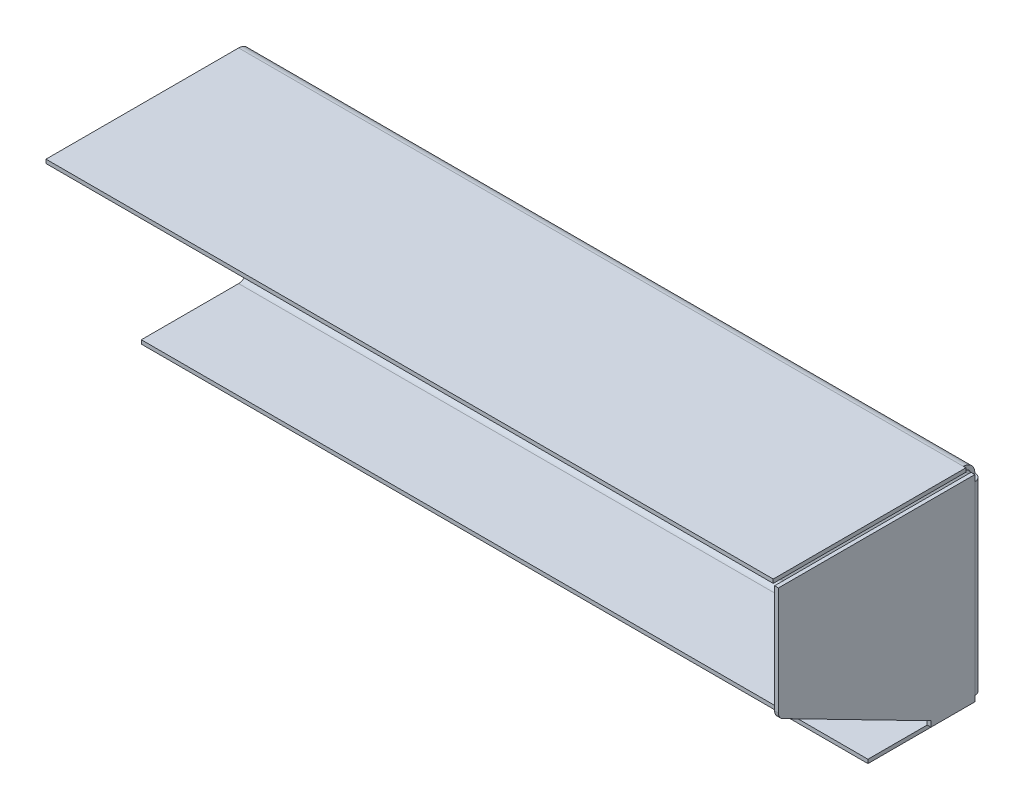
ISO-10303-21;
HEADER;
FILE_DESCRIPTION(('STEP AP214'),'2;1');
FILE_NAME('part.step','',(''),(''),'','','');
FILE_SCHEMA(('AUTOMOTIVE_DESIGN { 1 0 10303 214 1 1 1 1 }'));
ENDSEC;
DATA;
#1=APPLICATION_CONTEXT('core data for automotive mechanical design processes');
#2=APPLICATION_PROTOCOL_DEFINITION('international standard','automotive_design',2000,#1);
#3=PRODUCT_CONTEXT('',#1,'mechanical');
#4=PRODUCT('Part','Part','',(#3));
#5=PRODUCT_RELATED_PRODUCT_CATEGORY('part','',(#4));
#6=PRODUCT_DEFINITION_FORMATION('','',#4);
#7=PRODUCT_DEFINITION_CONTEXT('part definition',#1,'design');
#8=PRODUCT_DEFINITION('design','',#6,#7);
#9=PRODUCT_DEFINITION_SHAPE('','',#8);
#10=(LENGTH_UNIT() NAMED_UNIT(*) SI_UNIT(.MILLI.,.METRE.));
#11=(NAMED_UNIT(*) PLANE_ANGLE_UNIT() SI_UNIT($,.RADIAN.));
#12=(NAMED_UNIT(*) SI_UNIT($,.STERADIAN.) SOLID_ANGLE_UNIT());
#13=UNCERTAINTY_MEASURE_WITH_UNIT(LENGTH_MEASURE(1.E-05),#10,'distance_accuracy_value','');
#14=(GEOMETRIC_REPRESENTATION_CONTEXT(3) GLOBAL_UNCERTAINTY_ASSIGNED_CONTEXT((#13)) GLOBAL_UNIT_ASSIGNED_CONTEXT((#10,
#11,#12)) REPRESENTATION_CONTEXT('',''));
#15=CARTESIAN_POINT('',(0.,0.,0.));
#16=DIRECTION('',(0.,0.,1.));
#17=DIRECTION('',(1.,0.,0.));
#18=AXIS2_PLACEMENT_3D('',#15,#16,#17);
#19=CARTESIAN_POINT('',(0.,0.,-1.99999999999995));
#20=DIRECTION('',(0.,0.,-1.));
#21=DIRECTION('',(-1.,0.,0.));
#22=AXIS2_PLACEMENT_3D('',#19,#20,#21);
#23=PLANE('',#22);
#24=CARTESIAN_POINT('',(175.,-12.5,-1.99999999999995));
#25=DIRECTION('',(0.,0.,1.));
#26=DIRECTION('',(1.,0.,0.));
#27=AXIS2_PLACEMENT_3D('',#24,#25,#26);
#28=CIRCLE('',#27,12.5);
#29=CARTESIAN_POINT('',(187.5,-12.5,-1.99999999999995));
#30=VERTEX_POINT('',#29);
#31=EDGE_CURVE('E456',#30,#30,#28,.T.);
#32=ORIENTED_EDGE('',*,*,#31,.T.);
#33=EDGE_LOOP('',(#32));
#34=FACE_BOUND('',#33,.T.);
#35=CARTESIAN_POINT('',(-175.,-12.5,-1.99999999999995));
#36=DIRECTION('',(0.,0.,1.));
#37=DIRECTION('',(-1.,0.,0.));
#38=AXIS2_PLACEMENT_3D('',#35,#36,#37);
#39=CIRCLE('',#38,12.5);
#40=CARTESIAN_POINT('',(-187.5,-12.5,-1.99999999999995));
#41=VERTEX_POINT('',#40);
#42=EDGE_CURVE('E450',#41,#41,#39,.T.);
#43=ORIENTED_EDGE('',*,*,#42,.T.);
#44=EDGE_LOOP('',(#43));
#45=FACE_BOUND('',#44,.T.);
#46=DIRECTION('',(1.,0.,0.));
#47=VECTOR('',#46,1.);
#48=CARTESIAN_POINT('',(-192.,48.5,-2.));
#49=LINE('',#48,#47);
#50=CARTESIAN_POINT('',(-192.,48.5,-2.));
#51=VERTEX_POINT('',#50);
#52=CARTESIAN_POINT('',(188.,48.4999999999999,-2.));
#53=VERTEX_POINT('',#52);
#54=EDGE_CURVE('E480',#51,#53,#49,.T.);
#55=ORIENTED_EDGE('',*,*,#54,.T.);
#56=DIRECTION('',(0.,-1.,0.));
#57=VECTOR('',#56,1.);
#58=CARTESIAN_POINT('',(188.,48.5,-1.99999999999997));
#59=LINE('',#58,#57);
#60=CARTESIAN_POINT('',(188.,-48.4999999999999,-1.99999999999995));
#61=VERTEX_POINT('',#60);
#62=EDGE_CURVE('E473',#53,#61,#59,.T.);
#63=ORIENTED_EDGE('',*,*,#62,.T.);
#64=DIRECTION('',(-1.,0.,0.));
#65=VECTOR('',#64,1.);
#66=CARTESIAN_POINT('',(192.,-48.5,-1.99999999999995));
#67=LINE('',#66,#65);
#68=CARTESIAN_POINT('',(-192.,-48.5,-1.99999999999995));
#69=VERTEX_POINT('',#68);
#70=EDGE_CURVE('E464',#61,#69,#67,.T.);
#71=ORIENTED_EDGE('',*,*,#70,.T.);
#72=DIRECTION('',(0.,-1.,0.));
#73=VECTOR('',#72,1.);
#74=CARTESIAN_POINT('',(-192.,-54.5,-1.99999999999995));
#75=LINE('',#74,#73);
#76=EDGE_CURVE('E461',#51,#69,#75,.T.);
#77=ORIENTED_EDGE('',*,*,#76,.F.);
#78=EDGE_LOOP('',(#55,#63,#71,#77));
#79=FACE_BOUND('',#78,.T.);
#80=ADVANCED_FACE('F107',(#34,#45,#79),#23,.T.);
#81=CARTESIAN_POINT('',(0.,0.,0.));
#82=DIRECTION('',(0.,0.,-1.));
#83=DIRECTION('',(-1.,0.,0.));
#84=AXIS2_PLACEMENT_3D('',#81,#82,#83);
#85=PLANE('',#84);
#86=CARTESIAN_POINT('',(175.,-12.5,0.));
#87=DIRECTION('',(0.,0.,1.));
#88=DIRECTION('',(1.,0.,0.));
#89=AXIS2_PLACEMENT_3D('',#86,#87,#88);
#90=CIRCLE('',#89,12.5);
#91=CARTESIAN_POINT('',(187.5,-12.5,0.));
#92=VERTEX_POINT('',#91);
#93=EDGE_CURVE('E453',#92,#92,#90,.T.);
#94=ORIENTED_EDGE('',*,*,#93,.F.);
#95=EDGE_LOOP('',(#94));
#96=FACE_BOUND('',#95,.T.);
#97=CARTESIAN_POINT('',(-175.,-12.5,0.));
#98=DIRECTION('',(0.,0.,1.));
#99=DIRECTION('',(-1.,0.,0.));
#100=AXIS2_PLACEMENT_3D('',#97,#98,#99);
#101=CIRCLE('',#100,12.5);
#102=CARTESIAN_POINT('',(-187.5,-12.5,0.));
#103=VERTEX_POINT('',#102);
#104=EDGE_CURVE('E445',#103,#103,#101,.T.);
#105=ORIENTED_EDGE('',*,*,#104,.F.);
#106=EDGE_LOOP('',(#105));
#107=FACE_BOUND('',#106,.T.);
#108=DIRECTION('',(0.,-1.,0.));
#109=VECTOR('',#108,1.);
#110=CARTESIAN_POINT('',(188.,48.5,0.));
#111=LINE('',#110,#109);
#112=CARTESIAN_POINT('',(188.,48.4999999999998,0.));
#113=VERTEX_POINT('',#112);
#114=CARTESIAN_POINT('',(188.,-48.5,0.));
#115=VERTEX_POINT('',#114);
#116=EDGE_CURVE('E122',#113,#115,#111,.T.);
#117=ORIENTED_EDGE('',*,*,#116,.F.);
#118=DIRECTION('',(1.,0.,0.));
#119=VECTOR('',#118,1.);
#120=CARTESIAN_POINT('',(-192.,48.5,0.));
#121=LINE('',#120,#119);
#122=CARTESIAN_POINT('',(-192.,48.5,0.));
#123=VERTEX_POINT('',#122);
#124=EDGE_CURVE('E115',#123,#113,#121,.T.);
#125=ORIENTED_EDGE('',*,*,#124,.F.);
#126=DIRECTION('',(0.,-1.,0.));
#127=VECTOR('',#126,1.);
#128=CARTESIAN_POINT('',(-192.,-54.5,0.));
#129=LINE('',#128,#127);
#130=CARTESIAN_POINT('',(-192.,-48.5,0.));
#131=VERTEX_POINT('',#130);
#132=EDGE_CURVE('E130',#123,#131,#129,.T.);
#133=ORIENTED_EDGE('',*,*,#132,.T.);
#134=DIRECTION('',(-1.,0.,0.));
#135=VECTOR('',#134,1.);
#136=CARTESIAN_POINT('',(192.,-48.5,0.));
#137=LINE('',#136,#135);
#138=EDGE_CURVE('E467',#115,#131,#137,.T.);
#139=ORIENTED_EDGE('',*,*,#138,.F.);
#140=EDGE_LOOP('',(#117,#125,#133,#139));
#141=FACE_BOUND('',#140,.T.);
#142=ADVANCED_FACE('F556',(#96,#107,#141),#85,.F.);
#143=CARTESIAN_POINT('',(-192.,-54.5,-1.99999999999995));
#144=DIRECTION('',(-1.,0.,0.));
#145=DIRECTION('',(0.,0.,1.));
#146=AXIS2_PLACEMENT_3D('',#143,#144,#145);
#147=PLANE('',#146);
#148=ORIENTED_EDGE('',*,*,#132,.F.);
#149=DIRECTION('',(0.,0.,-1.));
#150=VECTOR('',#149,1.);
#151=CARTESIAN_POINT('',(-192.,48.5,0.));
#152=LINE('',#151,#150);
#153=EDGE_CURVE('E482',#123,#51,#152,.T.);
#154=ORIENTED_EDGE('',*,*,#153,.T.);
#155=ORIENTED_EDGE('',*,*,#76,.T.);
#156=DIRECTION('',(0.,0.,-1.));
#157=VECTOR('',#156,1.);
#158=CARTESIAN_POINT('',(-192.,-48.5,0.));
#159=LINE('',#158,#157);
#160=EDGE_CURVE('E470',#131,#69,#159,.T.);
#161=ORIENTED_EDGE('',*,*,#160,.F.);
#162=EDGE_LOOP('',(#148,#154,#155,#161));
#163=FACE_BOUND('',#162,.T.);
#164=ADVANCED_FACE('F109',(#163),#147,.T.);
#165=CARTESIAN_POINT('',(175.,-12.5,-1.99999999999995));
#166=DIRECTION('',(0.,0.,1.));
#167=DIRECTION('',(1.,0.,0.));
#168=AXIS2_PLACEMENT_3D('',#165,#166,#167);
#169=CYLINDRICAL_SURFACE('',#168,12.5);
#170=ORIENTED_EDGE('',*,*,#31,.F.);
#171=EDGE_LOOP('',(#170));
#172=FACE_BOUND('',#171,.T.);
#173=ORIENTED_EDGE('',*,*,#93,.T.);
#174=EDGE_LOOP('',(#173));
#175=FACE_BOUND('',#174,.T.);
#176=ADVANCED_FACE('F565',(#172,#175),#169,.F.);
#177=CARTESIAN_POINT('',(-175.,-12.5,-1.99999999999995));
#178=DIRECTION('',(0.,0.,1.));
#179=DIRECTION('',(1.,0.,0.));
#180=AXIS2_PLACEMENT_3D('',#177,#178,#179);
#181=CYLINDRICAL_SURFACE('',#180,12.5);
#182=ORIENTED_EDGE('',*,*,#42,.F.);
#183=EDGE_LOOP('',(#182));
#184=FACE_BOUND('',#183,.T.);
#185=ORIENTED_EDGE('',*,*,#104,.T.);
#186=EDGE_LOOP('',(#185));
#187=FACE_BOUND('',#186,.T.);
#188=ADVANCED_FACE('F568',(#184,#187),#181,.F.);
#189=CARTESIAN_POINT('',(-192.,-48.5,4.00000000000006));
#190=DIRECTION('',(-1.,0.,0.));
#191=DIRECTION('',(0.,0.,1.));
#192=AXIS2_PLACEMENT_3D('',#189,#190,#191);
#193=PLANE('',#192);
#194=DIRECTION('',(0.,-1.,0.));
#195=VECTOR('',#194,1.);
#196=CARTESIAN_POINT('',(-192.,-54.5,4.00000000000009));
#197=LINE('',#196,#195);
#198=CARTESIAN_POINT('',(-192.,-52.5,4.00000000000011));
#199=VERTEX_POINT('',#198);
#200=CARTESIAN_POINT('',(-192.,-54.5,4.00000000000003));
#201=VERTEX_POINT('',#200);
#202=EDGE_CURVE('E405',#199,#201,#197,.T.);
#203=ORIENTED_EDGE('',*,*,#202,.F.);
#204=CARTESIAN_POINT('',(-192.,-48.5,4.00000000000006));
#205=DIRECTION('',(-1.,0.,0.));
#206=DIRECTION('',(0.,0.,1.));
#207=AXIS2_PLACEMENT_3D('',#204,#205,#206);
#208=CIRCLE('',#207,4.);
#209=EDGE_CURVE('E401',#199,#131,#208,.F.);
#210=ORIENTED_EDGE('',*,*,#209,.T.);
#211=ORIENTED_EDGE('',*,*,#160,.T.);
#212=CARTESIAN_POINT('',(-192.,-48.5,4.00000000000006));
#213=DIRECTION('',(1.,0.,0.));
#214=DIRECTION('',(0.,0.,-1.));
#215=AXIS2_PLACEMENT_3D('',#212,#213,#214);
#216=CIRCLE('',#215,6.);
#217=EDGE_CURVE('E438',#201,#69,#216,.T.);
#218=ORIENTED_EDGE('',*,*,#217,.F.);
#219=EDGE_LOOP('',(#203,#210,#211,#218));
#220=FACE_BOUND('',#219,.T.);
#221=ADVANCED_FACE('F513',(#220),#193,.T.);
#222=CARTESIAN_POINT('',(188.,-48.5,4.00000000000006));
#223=DIRECTION('',(1.,0.,0.));
#224=DIRECTION('',(0.,0.,-1.));
#225=AXIS2_PLACEMENT_3D('',#222,#223,#224);
#226=PLANE('',#225);
#227=CARTESIAN_POINT('',(188.,-48.5,4.00000000000006));
#228=DIRECTION('',(-1.,0.,0.));
#229=DIRECTION('',(0.,0.,1.));
#230=AXIS2_PLACEMENT_3D('',#227,#228,#229);
#231=CIRCLE('',#230,4.);
#232=CARTESIAN_POINT('',(188.,-52.5,4.00000000000011));
#233=VERTEX_POINT('',#232);
#234=EDGE_CURVE('E442',#115,#233,#231,.T.);
#235=ORIENTED_EDGE('',*,*,#234,.T.);
#236=DIRECTION('',(0.,-1.,0.));
#237=VECTOR('',#236,1.);
#238=CARTESIAN_POINT('',(188.,-52.5,4.00000000000011));
#239=LINE('',#238,#237);
#240=CARTESIAN_POINT('',(188.,-54.5,4.00000000000011));
#241=VERTEX_POINT('',#240);
#242=EDGE_CURVE('E430',#233,#241,#239,.T.);
#243=ORIENTED_EDGE('',*,*,#242,.T.);
#244=CARTESIAN_POINT('',(188.,-48.5,4.00000000000006));
#245=DIRECTION('',(-1.,0.,0.));
#246=DIRECTION('',(0.,0.,1.));
#247=AXIS2_PLACEMENT_3D('',#244,#245,#246);
#248=CIRCLE('',#247,6.);
#249=EDGE_CURVE('E441',#61,#241,#248,.T.);
#250=ORIENTED_EDGE('',*,*,#249,.F.);
#251=DIRECTION('',(0.,0.,-1.));
#252=VECTOR('',#251,1.);
#253=CARTESIAN_POINT('',(188.,-48.5,0.));
#254=LINE('',#253,#252);
#255=EDGE_CURVE('E477',#115,#61,#254,.T.);
#256=ORIENTED_EDGE('',*,*,#255,.F.);
#257=EDGE_LOOP('',(#235,#243,#250,#256));
#258=FACE_BOUND('',#257,.T.);
#259=ADVANCED_FACE('F526',(#258),#226,.T.);
#260=CARTESIAN_POINT('',(378.086417841399,-48.5,4.00000000000003));
#261=DIRECTION('',(-1.,0.,0.));
#262=DIRECTION('',(0.,0.,1.));
#263=AXIS2_PLACEMENT_3D('',#260,#261,#262);
#264=CYLINDRICAL_SURFACE('',#263,6.);
#265=ORIENTED_EDGE('',*,*,#70,.F.);
#266=ORIENTED_EDGE('',*,*,#249,.T.);
#267=DIRECTION('',(-1.,0.,0.));
#268=VECTOR('',#267,1.);
#269=CARTESIAN_POINT('',(-192.,-54.5,4.00000000000009));
#270=LINE('',#269,#268);
#271=EDGE_CURVE('E330',#241,#201,#270,.T.);
#272=ORIENTED_EDGE('',*,*,#271,.T.);
#273=ORIENTED_EDGE('',*,*,#217,.T.);
#274=EDGE_LOOP('',(#265,#266,#272,#273));
#275=FACE_BOUND('',#274,.T.);
#276=ADVANCED_FACE('F517',(#275),#264,.T.);
#277=CARTESIAN_POINT('',(378.086417841399,-48.5,4.00000000000003));
#278=DIRECTION('',(-1.,0.,0.));
#279=DIRECTION('',(0.,0.,1.));
#280=AXIS2_PLACEMENT_3D('',#277,#278,#279);
#281=CYLINDRICAL_SURFACE('',#280,4.);
#282=ORIENTED_EDGE('',*,*,#138,.T.);
#283=ORIENTED_EDGE('',*,*,#209,.F.);
#284=DIRECTION('',(1.,0.,0.));
#285=VECTOR('',#284,1.);
#286=CARTESIAN_POINT('',(-192.,-52.5,4.00000000000009));
#287=LINE('',#286,#285);
#288=EDGE_CURVE('E433',#199,#233,#287,.T.);
#289=ORIENTED_EDGE('',*,*,#288,.T.);
#290=ORIENTED_EDGE('',*,*,#234,.F.);
#291=EDGE_LOOP('',(#282,#283,#289,#290));
#292=FACE_BOUND('',#291,.T.);
#293=ADVANCED_FACE('F533',(#292),#281,.F.);
#294=CARTESIAN_POINT('',(-192.,-54.5000000000002,55.0000000000001));
#295=DIRECTION('',(0.,0.,-1.));
#296=DIRECTION('',(0.,1.,0.));
#297=AXIS2_PLACEMENT_3D('',#294,#295,#296);
#298=PLANE('',#297);
#299=DIRECTION('',(-1.,0.,0.));
#300=VECTOR('',#299,1.);
#301=CARTESIAN_POINT('',(0.,-54.5000000000001,55.0000000000001));
#302=LINE('',#301,#300);
#303=CARTESIAN_POINT('',(188.93933982822,-54.5000000000001,55.0000000000001));
#304=VERTEX_POINT('',#303);
#305=CARTESIAN_POINT('',(-192.,-54.5000000000002,55.0000000000001));
#306=VERTEX_POINT('',#305);
#307=EDGE_CURVE('E418',#304,#306,#302,.T.);
#308=ORIENTED_EDGE('',*,*,#307,.F.);
#309=DIRECTION('',(0.,1.,0.));
#310=VECTOR('',#309,1.);
#311=CARTESIAN_POINT('',(188.93933982822,-54.5000000000001,55.0000000000001));
#312=LINE('',#311,#310);
#313=CARTESIAN_POINT('',(188.93933982822,-52.5000000000001,55.0000000000001));
#314=VERTEX_POINT('',#313);
#315=EDGE_CURVE('E427',#304,#314,#312,.T.);
#316=ORIENTED_EDGE('',*,*,#315,.T.);
#317=DIRECTION('',(1.,0.,0.));
#318=VECTOR('',#317,1.);
#319=CARTESIAN_POINT('',(-192.,-52.5000000000002,55.0000000000001));
#320=LINE('',#319,#318);
#321=CARTESIAN_POINT('',(-192.,-52.5000000000002,55.0000000000001));
#322=VERTEX_POINT('',#321);
#323=EDGE_CURVE('E425',#314,#322,#320,.F.);
#324=ORIENTED_EDGE('',*,*,#323,.T.);
#325=DIRECTION('',(0.,1.,0.));
#326=VECTOR('',#325,1.);
#327=CARTESIAN_POINT('',(-192.,-54.5000000000002,55.0000000000001));
#328=LINE('',#327,#326);
#329=EDGE_CURVE('E402',#306,#322,#328,.T.);
#330=ORIENTED_EDGE('',*,*,#329,.F.);
#331=EDGE_LOOP('',(#308,#316,#324,#330));
#332=FACE_BOUND('',#331,.T.);
#333=ADVANCED_FACE('F544',(#332),#298,.F.);
#334=CARTESIAN_POINT('',(188.939339828219,-54.499999999999,-383.371914314912));
#335=DIRECTION('',(-1.,0.,0.));
#336=DIRECTION('',(0.,0.,1.));
#337=AXIS2_PLACEMENT_3D('',#334,#335,#336);
#338=PLANE('',#337);
#339=DIRECTION('',(0.,0.,1.));
#340=VECTOR('',#339,1.);
#341=CARTESIAN_POINT('',(188.93933982822,-52.4999999999999,-6.93889390390723E-13));
#342=LINE('',#341,#340);
#343=CARTESIAN_POINT('',(188.93933982822,-52.5,4.00000000000011));
#344=VERTEX_POINT('',#343);
#345=EDGE_CURVE('E423',#344,#314,#342,.T.);
#346=ORIENTED_EDGE('',*,*,#345,.T.);
#347=ORIENTED_EDGE('',*,*,#315,.F.);
#348=DIRECTION('',(0.,0.,1.));
#349=VECTOR('',#348,1.);
#350=CARTESIAN_POINT('',(188.939339828219,-54.499999999999,-383.371914314912));
#351=LINE('',#350,#349);
#352=CARTESIAN_POINT('',(188.93933982822,-54.5,4.00000000000011));
#353=VERTEX_POINT('',#352);
#354=EDGE_CURVE('E420',#353,#304,#351,.T.);
#355=ORIENTED_EDGE('',*,*,#354,.F.);
#356=DIRECTION('',(0.,-1.,0.));
#357=VECTOR('',#356,1.);
#358=CARTESIAN_POINT('',(188.93933982822,-54.5,4.00000000000011));
#359=LINE('',#358,#357);
#360=EDGE_CURVE('E409',#344,#353,#359,.T.);
#361=ORIENTED_EDGE('',*,*,#360,.F.);
#362=EDGE_LOOP('',(#346,#347,#355,#361));
#363=FACE_BOUND('',#362,.T.);
#364=ADVANCED_FACE('F546',(#363),#338,.F.);
#365=CARTESIAN_POINT('',(0.,-54.5,0.));
#366=DIRECTION('',(0.,1.,0.));
#367=DIRECTION('',(0.,0.,1.));
#368=AXIS2_PLACEMENT_3D('',#365,#366,#367);
#369=PLANE('',#368);
#370=DIRECTION('',(1.,0.,0.));
#371=VECTOR('',#370,1.);
#372=CARTESIAN_POINT('',(-192.,-54.5,4.00000000000009));
#373=LINE('',#372,#371);
#374=EDGE_CURVE('E407',#353,#241,#373,.F.);
#375=ORIENTED_EDGE('',*,*,#374,.F.);
#376=ORIENTED_EDGE('',*,*,#354,.T.);
#377=ORIENTED_EDGE('',*,*,#307,.T.);
#378=DIRECTION('',(0.,0.,-1.));
#379=VECTOR('',#378,1.);
#380=CARTESIAN_POINT('',(-192.,-54.5,0.));
#381=LINE('',#380,#379);
#382=EDGE_CURVE('E415',#306,#201,#381,.T.);
#383=ORIENTED_EDGE('',*,*,#382,.T.);
#384=ORIENTED_EDGE('',*,*,#271,.F.);
#385=EDGE_LOOP('',(#375,#376,#377,#383,#384));
#386=FACE_BOUND('',#385,.T.);
#387=ADVANCED_FACE('F522',(#386),#369,.F.);
#388=CARTESIAN_POINT('',(0.,0.,4.00000000000028));
#389=DIRECTION('',(0.,0.,1.));
#390=DIRECTION('',(0.,-1.,0.));
#391=AXIS2_PLACEMENT_3D('',#388,#389,#390);
#392=PLANE('',#391);
#393=DIRECTION('',(1.,0.,0.));
#394=VECTOR('',#393,1.);
#395=CARTESIAN_POINT('',(-192.,-52.5,4.00000000000009));
#396=LINE('',#395,#394);
#397=EDGE_CURVE('E412',#233,#344,#396,.T.);
#398=ORIENTED_EDGE('',*,*,#397,.T.);
#399=ORIENTED_EDGE('',*,*,#360,.T.);
#400=ORIENTED_EDGE('',*,*,#374,.T.);
#401=ORIENTED_EDGE('',*,*,#242,.F.);
#402=EDGE_LOOP('',(#398,#399,#400,#401));
#403=FACE_BOUND('',#402,.T.);
#404=ADVANCED_FACE('F530',(#403),#392,.F.);
#405=CARTESIAN_POINT('',(0.,-52.5,0.));
#406=DIRECTION('',(0.,1.,0.));
#407=DIRECTION('',(0.,0.,1.));
#408=AXIS2_PLACEMENT_3D('',#405,#406,#407);
#409=PLANE('',#408);
#410=ORIENTED_EDGE('',*,*,#345,.F.);
#411=ORIENTED_EDGE('',*,*,#397,.F.);
#412=ORIENTED_EDGE('',*,*,#288,.F.);
#413=DIRECTION('',(0.,0.,1.));
#414=VECTOR('',#413,1.);
#415=CARTESIAN_POINT('',(-192.,-52.5,1.11022302462516E-13));
#416=LINE('',#415,#414);
#417=EDGE_CURVE('E399',#322,#199,#416,.F.);
#418=ORIENTED_EDGE('',*,*,#417,.F.);
#419=ORIENTED_EDGE('',*,*,#323,.F.);
#420=EDGE_LOOP('',(#410,#411,#412,#418,#419));
#421=FACE_BOUND('',#420,.T.);
#422=ADVANCED_FACE('F537',(#421),#409,.T.);
#423=CARTESIAN_POINT('',(-192.,-54.5,1.11022302462516E-13));
#424=DIRECTION('',(1.,0.,0.));
#425=DIRECTION('',(0.,1.,0.));
#426=AXIS2_PLACEMENT_3D('',#423,#424,#425);
#427=PLANE('',#426);
#428=ORIENTED_EDGE('',*,*,#202,.T.);
#429=ORIENTED_EDGE('',*,*,#382,.F.);
#430=ORIENTED_EDGE('',*,*,#329,.T.);
#431=ORIENTED_EDGE('',*,*,#417,.T.);
#432=EDGE_LOOP('',(#428,#429,#430,#431));
#433=FACE_BOUND('',#432,.T.);
#434=ADVANCED_FACE('F540',(#433),#427,.F.);
#435=CARTESIAN_POINT('',(192.,-51.4393398282202,2.00000000000003));
#436=DIRECTION('',(0.,-1.,0.));
#437=DIRECTION('',(0.,0.,1.));
#438=AXIS2_PLACEMENT_3D('',#435,#436,#437);
#439=PLANE('',#438);
#440=DIRECTION('',(0.,0.,1.));
#441=VECTOR('',#440,1.);
#442=CARTESIAN_POINT('',(190.,-51.4393398282202,2.00000000000006));
#443=LINE('',#442,#441);
#444=CARTESIAN_POINT('',(190.,-51.4393398282202,2.00000000000006));
#445=VERTEX_POINT('',#444);
#446=CARTESIAN_POINT('',(190.,-51.4393398282203,25.));
#447=VERTEX_POINT('',#446);
#448=EDGE_CURVE('E340',#445,#447,#443,.T.);
#449=ORIENTED_EDGE('',*,*,#448,.F.);
#450=DIRECTION('',(-1.,0.,0.));
#451=VECTOR('',#450,1.);
#452=CARTESIAN_POINT('',(192.,-51.4393398282202,2.00000000000003));
#453=LINE('',#452,#451);
#454=CARTESIAN_POINT('',(192.,-51.4393398282202,2.00000000000003));
#455=VERTEX_POINT('',#454);
#456=EDGE_CURVE('E328',#455,#445,#453,.T.);
#457=ORIENTED_EDGE('',*,*,#456,.F.);
#458=DIRECTION('',(0.,0.,1.));
#459=VECTOR('',#458,1.);
#460=CARTESIAN_POINT('',(192.,-51.4393398282202,2.00000000000003));
#461=LINE('',#460,#459);
#462=CARTESIAN_POINT('',(192.,-51.4393398282203,25.));
#463=VERTEX_POINT('',#462);
#464=EDGE_CURVE('E388',#455,#463,#461,.T.);
#465=ORIENTED_EDGE('',*,*,#464,.T.);
#466=DIRECTION('',(-1.,0.,0.));
#467=VECTOR('',#466,1.);
#468=CARTESIAN_POINT('',(192.,-51.4393398282203,25.));
#469=LINE('',#468,#467);
#470=EDGE_CURVE('E386',#463,#447,#469,.T.);
#471=ORIENTED_EDGE('',*,*,#470,.T.);
#472=EDGE_LOOP('',(#449,#457,#465,#471));
#473=FACE_BOUND('',#472,.T.);
#474=ADVANCED_FACE('F583',(#473),#439,.T.);
#475=CARTESIAN_POINT('',(192.,-51.4393398282203,25.));
#476=DIRECTION('',(0.,0.,1.));
#477=DIRECTION('',(1.,0.,0.));
#478=AXIS2_PLACEMENT_3D('',#475,#476,#477);
#479=PLANE('',#478);
#480=DIRECTION('',(0.,1.,0.));
#481=VECTOR('',#480,1.);
#482=CARTESIAN_POINT('',(190.,-51.4393398282203,25.));
#483=LINE('',#482,#481);
#484=CARTESIAN_POINT('',(190.,-48.5,25.));
#485=VERTEX_POINT('',#484);
#486=EDGE_CURVE('E337',#447,#485,#483,.T.);
#487=ORIENTED_EDGE('',*,*,#486,.F.);
#488=ORIENTED_EDGE('',*,*,#470,.F.);
#489=DIRECTION('',(0.,1.,0.));
#490=VECTOR('',#489,1.);
#491=CARTESIAN_POINT('',(192.,-51.4393398282203,25.));
#492=LINE('',#491,#490);
#493=CARTESIAN_POINT('',(192.,-48.5,25.));
#494=VERTEX_POINT('',#493);
#495=EDGE_CURVE('E383',#463,#494,#492,.T.);
#496=ORIENTED_EDGE('',*,*,#495,.T.);
#497=DIRECTION('',(-1.,0.,0.));
#498=VECTOR('',#497,1.);
#499=CARTESIAN_POINT('',(192.,-48.5,25.));
#500=LINE('',#499,#498);
#501=EDGE_CURVE('E380',#494,#485,#500,.T.);
#502=ORIENTED_EDGE('',*,*,#501,.T.);
#503=EDGE_LOOP('',(#487,#488,#496,#502));
#504=FACE_BOUND('',#503,.T.);
#505=ADVANCED_FACE('F605',(#504),#479,.T.);
#506=CARTESIAN_POINT('',(192.,-8.61501387863335,102.824363163642));
#507=DIRECTION('',(0.,0.889933250556874,-0.456090790910402));
#508=DIRECTION('',(0.,0.456090790910402,0.889933250556874));
#509=AXIS2_PLACEMENT_3D('',#506,#507,#508);
#510=PLANE('',#509);
#511=DIRECTION('',(0.,0.456090790910402,0.889933250556874));
#512=VECTOR('',#511,1.);
#513=CARTESIAN_POINT('',(190.,-8.61501387863335,102.824363163642));
#514=LINE('',#513,#512);
#515=CARTESIAN_POINT('',(190.,-8.61501387863335,102.824363163642));
#516=VERTEX_POINT('',#515);
#517=EDGE_CURVE('E378',#516,#485,#514,.F.);
#518=ORIENTED_EDGE('',*,*,#517,.T.);
#519=ORIENTED_EDGE('',*,*,#501,.F.);
#520=DIRECTION('',(0.,-0.456090790910402,-0.889933250556874));
#521=VECTOR('',#520,1.);
#522=CARTESIAN_POINT('',(192.,-8.61501387863334,102.824363163642));
#523=LINE('',#522,#521);
#524=CARTESIAN_POINT('',(192.,-8.61501387863335,102.824363163642));
#525=VERTEX_POINT('',#524);
#526=EDGE_CURVE('E348',#525,#494,#523,.T.);
#527=ORIENTED_EDGE('',*,*,#526,.F.);
#528=DIRECTION('',(-1.,0.,0.));
#529=VECTOR('',#528,1.);
#530=CARTESIAN_POINT('',(192.,-8.61501387863336,102.824363163642));
#531=LINE('',#530,#529);
#532=EDGE_CURVE('E375',#525,#516,#531,.T.);
#533=ORIENTED_EDGE('',*,*,#532,.T.);
#534=EDGE_LOOP('',(#518,#519,#527,#533));
#535=FACE_BOUND('',#534,.T.);
#536=ADVANCED_FACE('F613',(#535),#510,.F.);
#537=CARTESIAN_POINT('',(192.,-5.05528087640585,101.));
#538=DIRECTION('',(-1.,0.,0.));
#539=DIRECTION('',(0.,0.,1.));
#540=AXIS2_PLACEMENT_3D('',#537,#538,#539);
#541=CYLINDRICAL_SURFACE('',#540,4.00000000000001);
#542=CARTESIAN_POINT('',(190.,-5.05528087640584,101.));
#543=DIRECTION('',(-1.,0.,0.));
#544=DIRECTION('',(0.,0.,1.));
#545=AXIS2_PLACEMENT_3D('',#542,#543,#544);
#546=CIRCLE('',#545,4.00000000000001);
#547=CARTESIAN_POINT('',(190.,-5.05528087640583,105.));
#548=VERTEX_POINT('',#547);
#549=EDGE_CURVE('E373',#548,#516,#546,.F.);
#550=ORIENTED_EDGE('',*,*,#549,.T.);
#551=ORIENTED_EDGE('',*,*,#532,.F.);
#552=CARTESIAN_POINT('',(192.,-5.05528087640585,101.));
#553=DIRECTION('',(-1.,0.,0.));
#554=DIRECTION('',(0.,0.,1.));
#555=AXIS2_PLACEMENT_3D('',#552,#553,#554);
#556=CIRCLE('',#555,4.00000000000001);
#557=CARTESIAN_POINT('',(192.,-5.05528087640584,105.));
#558=VERTEX_POINT('',#557);
#559=EDGE_CURVE('E350',#558,#525,#556,.F.);
#560=ORIENTED_EDGE('',*,*,#559,.F.);
#561=DIRECTION('',(-1.,0.,0.));
#562=VECTOR('',#561,1.);
#563=CARTESIAN_POINT('',(192.,-5.05528087640583,105.));
#564=LINE('',#563,#562);
#565=EDGE_CURVE('E370',#558,#548,#564,.T.);
#566=ORIENTED_EDGE('',*,*,#565,.T.);
#567=EDGE_LOOP('',(#550,#551,#560,#566));
#568=FACE_BOUND('',#567,.T.);
#569=ADVANCED_FACE('F621',(#568),#541,.T.);
#570=CARTESIAN_POINT('',(192.,48.5000000000003,105.));
#571=DIRECTION('',(0.,0.,-1.));
#572=DIRECTION('',(-1.,0.,0.));
#573=AXIS2_PLACEMENT_3D('',#570,#571,#572);
#574=PLANE('',#573);
#575=DIRECTION('',(0.,1.,0.));
#576=VECTOR('',#575,1.);
#577=CARTESIAN_POINT('',(190.,48.5000000000003,105.));
#578=LINE('',#577,#576);
#579=CARTESIAN_POINT('',(190.,51.7928932188139,105.));
#580=VERTEX_POINT('',#579);
#581=EDGE_CURVE('E368',#580,#548,#578,.F.);
#582=ORIENTED_EDGE('',*,*,#581,.T.);
#583=ORIENTED_EDGE('',*,*,#565,.F.);
#584=DIRECTION('',(0.,-1.,0.));
#585=VECTOR('',#584,1.);
#586=CARTESIAN_POINT('',(192.,-5.05528087640585,105.));
#587=LINE('',#586,#585);
#588=CARTESIAN_POINT('',(192.,51.7928932188139,105.));
#589=VERTEX_POINT('',#588);
#590=EDGE_CURVE('E352',#589,#558,#587,.T.);
#591=ORIENTED_EDGE('',*,*,#590,.F.);
#592=DIRECTION('',(-1.,0.,0.));
#593=VECTOR('',#592,1.);
#594=CARTESIAN_POINT('',(192.,51.7928932188139,105.));
#595=LINE('',#594,#593);
#596=EDGE_CURVE('E365',#589,#580,#595,.T.);
#597=ORIENTED_EDGE('',*,*,#596,.T.);
#598=EDGE_LOOP('',(#582,#583,#591,#597));
#599=FACE_BOUND('',#598,.T.);
#600=ADVANCED_FACE('F629',(#599),#574,.F.);
#601=CARTESIAN_POINT('',(192.,51.7928932188135,2.00000000000005));
#602=DIRECTION('',(0.,-1.,0.));
#603=DIRECTION('',(0.,0.,-1.));
#604=AXIS2_PLACEMENT_3D('',#601,#602,#603);
#605=PLANE('',#604);
#606=DIRECTION('',(0.,0.,1.));
#607=VECTOR('',#606,1.);
#608=CARTESIAN_POINT('',(190.,51.7928932188135,2.00000000000006));
#609=LINE('',#608,#607);
#610=CARTESIAN_POINT('',(190.,51.7928932188135,2.00000000000006));
#611=VERTEX_POINT('',#610);
#612=EDGE_CURVE('E362',#611,#580,#609,.T.);
#613=ORIENTED_EDGE('',*,*,#612,.T.);
#614=ORIENTED_EDGE('',*,*,#596,.F.);
#615=DIRECTION('',(0.,0.,1.));
#616=VECTOR('',#615,1.);
#617=CARTESIAN_POINT('',(192.,51.7928932188135,2.00000000000005));
#618=LINE('',#617,#616);
#619=CARTESIAN_POINT('',(192.,51.7928932188135,2.00000000000005));
#620=VERTEX_POINT('',#619);
#621=EDGE_CURVE('E354',#620,#589,#618,.T.);
#622=ORIENTED_EDGE('',*,*,#621,.F.);
#623=DIRECTION('',(-1.,0.,0.));
#624=VECTOR('',#623,1.);
#625=CARTESIAN_POINT('',(192.,51.7928932188135,2.00000000000005));
#626=LINE('',#625,#624);
#627=EDGE_CURVE('E359',#620,#611,#626,.T.);
#628=ORIENTED_EDGE('',*,*,#627,.T.);
#629=EDGE_LOOP('',(#613,#614,#622,#628));
#630=FACE_BOUND('',#629,.T.);
#631=ADVANCED_FACE('F637',(#630),#605,.F.);
#632=CARTESIAN_POINT('',(192.,-5.05528087640585,101.));
#633=DIRECTION('',(-1.,0.,0.));
#634=DIRECTION('',(0.,0.,1.));
#635=AXIS2_PLACEMENT_3D('',#632,#633,#634);
#636=PLANE('',#635);
#637=DIRECTION('',(0.,-1.,0.));
#638=VECTOR('',#637,1.);
#639=CARTESIAN_POINT('',(192.,-48.5,2.00000000000003));
#640=LINE('',#639,#638);
#641=CARTESIAN_POINT('',(192.,48.5,1.99999999999999));
#642=VERTEX_POINT('',#641);
#643=CARTESIAN_POINT('',(192.,-48.4999999999999,1.99999999999999));
#644=VERTEX_POINT('',#643);
#645=EDGE_CURVE('E323',#642,#644,#640,.T.);
#646=ORIENTED_EDGE('',*,*,#645,.F.);
#647=DIRECTION('',(0.,1.,0.));
#648=VECTOR('',#647,1.);
#649=CARTESIAN_POINT('',(192.,48.5,2.00000000000005));
#650=LINE('',#649,#648);
#651=EDGE_CURVE('E357',#642,#620,#650,.T.);
#652=ORIENTED_EDGE('',*,*,#651,.T.);
#653=ORIENTED_EDGE('',*,*,#621,.T.);
#654=ORIENTED_EDGE('',*,*,#590,.T.);
#655=ORIENTED_EDGE('',*,*,#559,.T.);
#656=ORIENTED_EDGE('',*,*,#526,.T.);
#657=ORIENTED_EDGE('',*,*,#495,.F.);
#658=ORIENTED_EDGE('',*,*,#464,.F.);
#659=DIRECTION('',(0.,-1.,0.));
#660=VECTOR('',#659,1.);
#661=CARTESIAN_POINT('',(192.,-48.5,2.00000000000003));
#662=LINE('',#661,#660);
#663=EDGE_CURVE('E331',#644,#455,#662,.T.);
#664=ORIENTED_EDGE('',*,*,#663,.F.);
#665=EDGE_LOOP('',(#646,#652,#653,#654,#655,#656,#657,#658,#664));
#666=FACE_BOUND('',#665,.T.);
#667=ADVANCED_FACE('F645',(#666),#636,.F.);
#668=CARTESIAN_POINT('',(192.,48.5,2.00000000000005));
#669=DIRECTION('',(0.,0.,1.));
#670=DIRECTION('',(1.,0.,0.));
#671=AXIS2_PLACEMENT_3D('',#668,#669,#670);
#672=PLANE('',#671);
#673=DIRECTION('',(0.,1.,0.));
#674=VECTOR('',#673,1.);
#675=CARTESIAN_POINT('',(190.,48.5,2.00000000000006));
#676=LINE('',#675,#674);
#677=CARTESIAN_POINT('',(190.,48.5,2.00000000000006));
#678=VERTEX_POINT('',#677);
#679=EDGE_CURVE('E346',#678,#611,#676,.T.);
#680=ORIENTED_EDGE('',*,*,#679,.T.);
#681=ORIENTED_EDGE('',*,*,#627,.F.);
#682=ORIENTED_EDGE('',*,*,#651,.F.);
#683=DIRECTION('',(1.,0.,0.));
#684=VECTOR('',#683,1.);
#685=CARTESIAN_POINT('',(190.,48.5,2.00000000000006));
#686=LINE('',#685,#684);
#687=EDGE_CURVE('E391',#678,#642,#686,.T.);
#688=ORIENTED_EDGE('',*,*,#687,.F.);
#689=EDGE_LOOP('',(#680,#681,#682,#688));
#690=FACE_BOUND('',#689,.T.);
#691=ADVANCED_FACE('F653',(#690),#672,.F.);
#692=CARTESIAN_POINT('',(190.,-5.05528087640584,101.));
#693=DIRECTION('',(-1.,0.,0.));
#694=DIRECTION('',(0.,0.,1.));
#695=AXIS2_PLACEMENT_3D('',#692,#693,#694);
#696=PLANE('',#695);
#697=ORIENTED_EDGE('',*,*,#581,.F.);
#698=ORIENTED_EDGE('',*,*,#612,.F.);
#699=ORIENTED_EDGE('',*,*,#679,.F.);
#700=DIRECTION('',(0.,1.,0.));
#701=VECTOR('',#700,1.);
#702=CARTESIAN_POINT('',(190.,-48.5,2.00000000000006));
#703=LINE('',#702,#701);
#704=CARTESIAN_POINT('',(190.,-48.5,2.00000000000006));
#705=VERTEX_POINT('',#704);
#706=EDGE_CURVE('E394',#705,#678,#703,.T.);
#707=ORIENTED_EDGE('',*,*,#706,.F.);
#708=DIRECTION('',(0.,-1.,0.));
#709=VECTOR('',#708,1.);
#710=CARTESIAN_POINT('',(190.,-48.5,2.00000000000006));
#711=LINE('',#710,#709);
#712=EDGE_CURVE('E343',#705,#445,#711,.T.);
#713=ORIENTED_EDGE('',*,*,#712,.T.);
#714=ORIENTED_EDGE('',*,*,#448,.T.);
#715=ORIENTED_EDGE('',*,*,#486,.T.);
#716=ORIENTED_EDGE('',*,*,#517,.F.);
#717=ORIENTED_EDGE('',*,*,#549,.F.);
#718=EDGE_LOOP('',(#697,#698,#699,#707,#713,#714,#715,#716,#717));
#719=FACE_BOUND('',#718,.T.);
#720=ADVANCED_FACE('F661',(#719),#696,.T.);
#721=CARTESIAN_POINT('',(192.,-48.5,2.00000000000003));
#722=DIRECTION('',(0.,0.,-1.));
#723=DIRECTION('',(-1.,0.,0.));
#724=AXIS2_PLACEMENT_3D('',#721,#722,#723);
#725=PLANE('',#724);
#726=ORIENTED_EDGE('',*,*,#712,.F.);
#727=DIRECTION('',(1.,0.,0.));
#728=VECTOR('',#727,1.);
#729=CARTESIAN_POINT('',(192.,-48.5,2.00000000000003));
#730=LINE('',#729,#728);
#731=EDGE_CURVE('E334',#705,#644,#730,.T.);
#732=ORIENTED_EDGE('',*,*,#731,.T.);
#733=ORIENTED_EDGE('',*,*,#663,.T.);
#734=ORIENTED_EDGE('',*,*,#456,.T.);
#735=EDGE_LOOP('',(#726,#732,#733,#734));
#736=FACE_BOUND('',#735,.T.);
#737=ADVANCED_FACE('F669',(#736),#725,.T.);
#738=CARTESIAN_POINT('',(188.,-48.5,2.00000000000004));
#739=DIRECTION('',(0.,-1.,0.));
#740=DIRECTION('',(0.,0.,-1.));
#741=AXIS2_PLACEMENT_3D('',#738,#739,#740);
#742=PLANE('',#741);
#743=ORIENTED_EDGE('',*,*,#731,.F.);
#744=CARTESIAN_POINT('',(188.,-48.4999999999999,2.00000000000004));
#745=DIRECTION('',(0.,1.,0.));
#746=DIRECTION('',(-1.,0.,0.));
#747=AXIS2_PLACEMENT_3D('',#744,#745,#746);
#748=CIRCLE('',#747,2.);
#749=EDGE_CURVE('E310',#705,#115,#748,.T.);
#750=ORIENTED_EDGE('',*,*,#749,.T.);
#751=ORIENTED_EDGE('',*,*,#255,.T.);
#752=CARTESIAN_POINT('',(188.,-48.5,2.00000000000004));
#753=DIRECTION('',(0.,1.,0.));
#754=DIRECTION('',(0.,0.,1.));
#755=AXIS2_PLACEMENT_3D('',#752,#753,#754);
#756=CIRCLE('',#755,4.);
#757=EDGE_CURVE('E317',#644,#61,#756,.T.);
#758=ORIENTED_EDGE('',*,*,#757,.F.);
#759=EDGE_LOOP('',(#743,#750,#751,#758));
#760=FACE_BOUND('',#759,.T.);
#761=ADVANCED_FACE('F677',(#760),#742,.T.);
#762=CARTESIAN_POINT('',(188.,48.4999999999999,2.00000000000005));
#763=DIRECTION('',(0.,1.,0.));
#764=DIRECTION('',(-1.,0.,0.));
#765=AXIS2_PLACEMENT_3D('',#762,#763,#764);
#766=PLANE('',#765);
#767=CARTESIAN_POINT('',(188.,48.4999999999998,2.00000000000005));
#768=DIRECTION('',(0.,1.,0.));
#769=DIRECTION('',(-1.,0.,0.));
#770=AXIS2_PLACEMENT_3D('',#767,#768,#769);
#771=CIRCLE('',#770,2.);
#772=EDGE_CURVE('E320',#113,#678,#771,.F.);
#773=ORIENTED_EDGE('',*,*,#772,.T.);
#774=ORIENTED_EDGE('',*,*,#687,.T.);
#775=CARTESIAN_POINT('',(188.,48.4999999999999,2.00000000000005));
#776=DIRECTION('',(0.,-1.,0.));
#777=DIRECTION('',(1.,0.,0.));
#778=AXIS2_PLACEMENT_3D('',#775,#776,#777);
#779=CIRCLE('',#778,4.);
#780=EDGE_CURVE('E319',#53,#642,#779,.T.);
#781=ORIENTED_EDGE('',*,*,#780,.F.);
#782=DIRECTION('',(0.,0.,-1.));
#783=VECTOR('',#782,1.);
#784=CARTESIAN_POINT('',(188.,48.5,0.));
#785=LINE('',#784,#783);
#786=EDGE_CURVE('E13',#113,#53,#785,.T.);
#787=ORIENTED_EDGE('',*,*,#786,.F.);
#788=EDGE_LOOP('',(#773,#774,#781,#787));
#789=FACE_BOUND('',#788,.T.);
#790=ADVANCED_FACE('F685',(#789),#766,.T.);
#791=CARTESIAN_POINT('',(188.,-97.1349916863251,2.00000000000004));
#792=DIRECTION('',(0.,1.,0.));
#793=DIRECTION('',(-1.,0.,0.));
#794=AXIS2_PLACEMENT_3D('',#791,#792,#793);
#795=CYLINDRICAL_SURFACE('',#794,4.);
#796=ORIENTED_EDGE('',*,*,#62,.F.);
#797=ORIENTED_EDGE('',*,*,#780,.T.);
#798=ORIENTED_EDGE('',*,*,#645,.T.);
#799=ORIENTED_EDGE('',*,*,#757,.T.);
#800=EDGE_LOOP('',(#796,#797,#798,#799));
#801=FACE_BOUND('',#800,.T.);
#802=ADVANCED_FACE('F693',(#801),#795,.T.);
#803=CARTESIAN_POINT('',(188.,-97.1349916863251,2.00000000000004));
#804=DIRECTION('',(0.,1.,0.));
#805=DIRECTION('',(-1.,0.,0.));
#806=AXIS2_PLACEMENT_3D('',#803,#804,#805);
#807=CYLINDRICAL_SURFACE('',#806,2.);
#808=ORIENTED_EDGE('',*,*,#116,.T.);
#809=ORIENTED_EDGE('',*,*,#749,.F.);
#810=ORIENTED_EDGE('',*,*,#706,.T.);
#811=ORIENTED_EDGE('',*,*,#772,.F.);
#812=EDGE_LOOP('',(#808,#809,#810,#811));
#813=FACE_BOUND('',#812,.T.);
#814=ADVANCED_FACE('F701',(#813),#807,.F.);
#815=CARTESIAN_POINT('',(-192.,48.5,4.));
#816=DIRECTION('',(-1.,0.,0.));
#817=DIRECTION('',(0.,0.,1.));
#818=AXIS2_PLACEMENT_3D('',#815,#816,#817);
#819=PLANE('',#818);
#820=ORIENTED_EDGE('',*,*,#153,.F.);
#821=CARTESIAN_POINT('',(-192.,48.5,4.));
#822=DIRECTION('',(1.,0.,0.));
#823=DIRECTION('',(0.,1.,0.));
#824=AXIS2_PLACEMENT_3D('',#821,#822,#823);
#825=CIRCLE('',#824,4.);
#826=CARTESIAN_POINT('',(-192.,52.5,4.00000000000015));
#827=VERTEX_POINT('',#826);
#828=EDGE_CURVE('E311',#123,#827,#825,.T.);
#829=ORIENTED_EDGE('',*,*,#828,.T.);
#830=DIRECTION('',(0.,1.,0.));
#831=VECTOR('',#830,1.);
#832=CARTESIAN_POINT('',(-192.,52.4999999999999,4.00000000000012));
#833=LINE('',#832,#831);
#834=CARTESIAN_POINT('',(-192.,54.4999999999999,4.0000000000001));
#835=VERTEX_POINT('',#834);
#836=EDGE_CURVE('E270',#827,#835,#833,.T.);
#837=ORIENTED_EDGE('',*,*,#836,.T.);
#838=CARTESIAN_POINT('',(-192.,48.5,4.));
#839=DIRECTION('',(1.,0.,0.));
#840=DIRECTION('',(0.,0.,-1.));
#841=AXIS2_PLACEMENT_3D('',#838,#839,#840);
#842=CIRCLE('',#841,6.);
#843=EDGE_CURVE('E303',#51,#835,#842,.T.);
#844=ORIENTED_EDGE('',*,*,#843,.F.);
#845=EDGE_LOOP('',(#820,#829,#837,#844));
#846=FACE_BOUND('',#845,.T.);
#847=ADVANCED_FACE('F508',(#846),#819,.T.);
#848=CARTESIAN_POINT('',(188.,48.5,4.));
#849=DIRECTION('',(1.,0.,0.));
#850=DIRECTION('',(0.,0.,-1.));
#851=AXIS2_PLACEMENT_3D('',#848,#849,#850);
#852=PLANE('',#851);
#853=CARTESIAN_POINT('',(188.,48.5,4.));
#854=DIRECTION('',(1.,0.,0.));
#855=DIRECTION('',(0.,1.,0.));
#856=AXIS2_PLACEMENT_3D('',#853,#854,#855);
#857=CIRCLE('',#856,4.);
#858=CARTESIAN_POINT('',(188.,52.5,4.00000000000015));
#859=VERTEX_POINT('',#858);
#860=EDGE_CURVE('E307',#859,#113,#857,.F.);
#861=ORIENTED_EDGE('',*,*,#860,.T.);
#862=ORIENTED_EDGE('',*,*,#786,.T.);
#863=CARTESIAN_POINT('',(188.,48.5,4.));
#864=DIRECTION('',(-1.,0.,0.));
#865=DIRECTION('',(0.,0.,1.));
#866=AXIS2_PLACEMENT_3D('',#863,#864,#865);
#867=CIRCLE('',#866,6.);
#868=CARTESIAN_POINT('',(188.,54.5,4.0000000000001));
#869=VERTEX_POINT('',#868);
#870=EDGE_CURVE('E306',#869,#53,#867,.T.);
#871=ORIENTED_EDGE('',*,*,#870,.F.);
#872=DIRECTION('',(0.,-1.,0.));
#873=VECTOR('',#872,1.);
#874=CARTESIAN_POINT('',(188.,54.5,4.0000000000001));
#875=LINE('',#874,#873);
#876=EDGE_CURVE('E297',#869,#859,#875,.T.);
#877=ORIENTED_EDGE('',*,*,#876,.T.);
#878=EDGE_LOOP('',(#861,#862,#871,#877));
#879=FACE_BOUND('',#878,.T.);
#880=ADVANCED_FACE('F490',(#879),#852,.T.);
#881=CARTESIAN_POINT('',(-382.086417841399,48.5,4.));
#882=DIRECTION('',(1.,0.,0.));
#883=DIRECTION('',(0.,1.,0.));
#884=AXIS2_PLACEMENT_3D('',#881,#882,#883);
#885=CYLINDRICAL_SURFACE('',#884,6.);
#886=DIRECTION('',(1.,0.,0.));
#887=VECTOR('',#886,1.);
#888=CARTESIAN_POINT('',(192.,54.5,4.00000000000013));
#889=LINE('',#888,#887);
#890=EDGE_CURVE('E300',#835,#869,#889,.T.);
#891=ORIENTED_EDGE('',*,*,#890,.T.);
#892=ORIENTED_EDGE('',*,*,#870,.T.);
#893=ORIENTED_EDGE('',*,*,#54,.F.);
#894=ORIENTED_EDGE('',*,*,#843,.T.);
#895=EDGE_LOOP('',(#891,#892,#893,#894));
#896=FACE_BOUND('',#895,.T.);
#897=ADVANCED_FACE('F504',(#896),#885,.T.);
#898=CARTESIAN_POINT('',(-382.086417841399,48.5,4.));
#899=DIRECTION('',(1.,0.,0.));
#900=DIRECTION('',(0.,1.,0.));
#901=AXIS2_PLACEMENT_3D('',#898,#899,#900);
#902=CYLINDRICAL_SURFACE('',#901,4.);
#903=DIRECTION('',(-1.,0.,0.));
#904=VECTOR('',#903,1.);
#905=CARTESIAN_POINT('',(192.,52.5,4.00000000000012));
#906=LINE('',#905,#904);
#907=EDGE_CURVE('E295',#859,#827,#906,.T.);
#908=ORIENTED_EDGE('',*,*,#907,.T.);
#909=ORIENTED_EDGE('',*,*,#828,.F.);
#910=ORIENTED_EDGE('',*,*,#124,.T.);
#911=ORIENTED_EDGE('',*,*,#860,.F.);
#912=EDGE_LOOP('',(#908,#909,#910,#911));
#913=FACE_BOUND('',#912,.T.);
#914=ADVANCED_FACE('F487',(#913),#902,.F.);
#915=CARTESIAN_POINT('',(192.,54.5000000000003,105.));
#916=DIRECTION('',(0.,0.,-1.));
#917=DIRECTION('',(0.,1.,0.));
#918=AXIS2_PLACEMENT_3D('',#915,#916,#917);
#919=PLANE('',#918);
#920=DIRECTION('',(0.,-1.,0.));
#921=VECTOR('',#920,1.);
#922=CARTESIAN_POINT('',(189.292893218814,54.5000000000003,105.));
#923=LINE('',#922,#921);
#924=CARTESIAN_POINT('',(189.292893218814,54.5000000000003,105.));
#925=VERTEX_POINT('',#924);
#926=CARTESIAN_POINT('',(189.292893218814,52.5000000000003,105.));
#927=VERTEX_POINT('',#926);
#928=EDGE_CURVE('E979',#925,#927,#923,.T.);
#929=ORIENTED_EDGE('',*,*,#928,.F.);
#930=DIRECTION('',(1.,0.,0.));
#931=VECTOR('',#930,1.);
#932=CARTESIAN_POINT('',(0.,54.5000000000003,105.));
#933=LINE('',#932,#931);
#934=CARTESIAN_POINT('',(-192.,54.5000000000003,105.));
#935=VERTEX_POINT('',#934);
#936=EDGE_CURVE('E276',#935,#925,#933,.T.);
#937=ORIENTED_EDGE('',*,*,#936,.F.);
#938=DIRECTION('',(0.,-1.,0.));
#939=VECTOR('',#938,1.);
#940=CARTESIAN_POINT('',(-192.,54.5000000000003,105.));
#941=LINE('',#940,#939);
#942=CARTESIAN_POINT('',(-192.,52.5000000000003,105.));
#943=VERTEX_POINT('',#942);
#944=EDGE_CURVE('E267',#935,#943,#941,.T.);
#945=ORIENTED_EDGE('',*,*,#944,.T.);
#946=DIRECTION('',(-1.,0.,0.));
#947=VECTOR('',#946,1.);
#948=CARTESIAN_POINT('',(192.,52.5000000000003,105.));
#949=LINE('',#948,#947);
#950=EDGE_CURVE('E282',#943,#927,#949,.F.);
#951=ORIENTED_EDGE('',*,*,#950,.T.);
#952=EDGE_LOOP('',(#929,#937,#945,#951));
#953=FACE_BOUND('',#952,.T.);
#954=ADVANCED_FACE('F281',(#953),#919,.F.);
#955=CARTESIAN_POINT('',(189.292893218812,54.4999999999986,-393.060448798416));
#956=DIRECTION('',(1.,0.,0.));
#957=DIRECTION('',(0.,1.,0.));
#958=AXIS2_PLACEMENT_3D('',#955,#956,#957);
#959=PLANE('',#958);
#960=DIRECTION('',(0.,1.,0.));
#961=VECTOR('',#960,1.);
#962=CARTESIAN_POINT('',(189.292893218814,54.5,4.00000000000011));
#963=LINE('',#962,#961);
#964=CARTESIAN_POINT('',(189.292893218814,52.5,4.00000000000012));
#965=VERTEX_POINT('',#964);
#966=CARTESIAN_POINT('',(189.292893218814,54.5,4.00000000000011));
#967=VERTEX_POINT('',#966);
#968=EDGE_CURVE('E288',#965,#967,#963,.T.);
#969=ORIENTED_EDGE('',*,*,#968,.T.);
#970=DIRECTION('',(0.,0.,1.));
#971=VECTOR('',#970,1.);
#972=CARTESIAN_POINT('',(189.292893218812,54.4999999999986,-393.060448798416));
#973=LINE('',#972,#971);
#974=EDGE_CURVE('E290',#967,#925,#973,.T.);
#975=ORIENTED_EDGE('',*,*,#974,.T.);
#976=ORIENTED_EDGE('',*,*,#928,.T.);
#977=DIRECTION('',(0.,0.,1.));
#978=VECTOR('',#977,1.);
#979=CARTESIAN_POINT('',(189.292893218814,52.5,-7.63278329429795E-13));
#980=LINE('',#979,#978);
#981=EDGE_CURVE('E275',#965,#927,#980,.T.);
#982=ORIENTED_EDGE('',*,*,#981,.F.);
#983=EDGE_LOOP('',(#969,#975,#976,#982));
#984=FACE_BOUND('',#983,.T.);
#985=ADVANCED_FACE('F740',(#984),#959,.T.);
#986=CARTESIAN_POINT('',(0.,54.5,0.));
#987=DIRECTION('',(0.,-1.,0.));
#988=DIRECTION('',(0.,0.,-1.));
#989=AXIS2_PLACEMENT_3D('',#986,#987,#988);
#990=PLANE('',#989);
#991=ORIENTED_EDGE('',*,*,#974,.F.);
#992=DIRECTION('',(-1.,0.,0.));
#993=VECTOR('',#992,1.);
#994=CARTESIAN_POINT('',(192.,54.5,4.00000000000013));
#995=LINE('',#994,#993);
#996=EDGE_CURVE('E498',#869,#967,#995,.F.);
#997=ORIENTED_EDGE('',*,*,#996,.F.);
#998=ORIENTED_EDGE('',*,*,#890,.F.);
#999=DIRECTION('',(0.,0.,1.));
#1000=VECTOR('',#999,1.);
#1001=CARTESIAN_POINT('',(-192.,54.4999999999999,0.));
#1002=LINE('',#1001,#1000);
#1003=EDGE_CURVE('E977',#835,#935,#1002,.T.);
#1004=ORIENTED_EDGE('',*,*,#1003,.T.);
#1005=ORIENTED_EDGE('',*,*,#936,.T.);
#1006=EDGE_LOOP('',(#991,#997,#998,#1004,#1005));
#1007=FACE_BOUND('',#1006,.T.);
#1008=ADVANCED_FACE('F501',(#1007),#990,.F.);
#1009=CARTESIAN_POINT('',(-192.,54.5000000000003,105.));
#1010=DIRECTION('',(1.,0.,0.));
#1011=DIRECTION('',(0.,0.,-1.));
#1012=AXIS2_PLACEMENT_3D('',#1009,#1010,#1011);
#1013=PLANE('',#1012);
#1014=ORIENTED_EDGE('',*,*,#836,.F.);
#1015=DIRECTION('',(0.,0.,-1.));
#1016=VECTOR('',#1015,1.);
#1017=CARTESIAN_POINT('',(-192.,52.5000000000003,105.));
#1018=LINE('',#1017,#1016);
#1019=EDGE_CURVE('E263',#827,#943,#1018,.F.);
#1020=ORIENTED_EDGE('',*,*,#1019,.T.);
#1021=ORIENTED_EDGE('',*,*,#944,.F.);
#1022=ORIENTED_EDGE('',*,*,#1003,.F.);
#1023=EDGE_LOOP('',(#1014,#1020,#1021,#1022));
#1024=FACE_BOUND('',#1023,.T.);
#1025=ADVANCED_FACE('F265',(#1024),#1013,.F.);
#1026=CARTESIAN_POINT('',(0.,52.5,0.));
#1027=DIRECTION('',(0.,-1.,0.));
#1028=DIRECTION('',(0.,0.,-1.));
#1029=AXIS2_PLACEMENT_3D('',#1026,#1027,#1028);
#1030=PLANE('',#1029);
#1031=DIRECTION('',(-1.,0.,0.));
#1032=VECTOR('',#1031,1.);
#1033=CARTESIAN_POINT('',(192.,52.5,4.00000000000012));
#1034=LINE('',#1033,#1032);
#1035=EDGE_CURVE('E314',#965,#859,#1034,.T.);
#1036=ORIENTED_EDGE('',*,*,#1035,.F.);
#1037=ORIENTED_EDGE('',*,*,#981,.T.);
#1038=ORIENTED_EDGE('',*,*,#950,.F.);
#1039=ORIENTED_EDGE('',*,*,#1019,.F.);
#1040=ORIENTED_EDGE('',*,*,#907,.F.);
#1041=EDGE_LOOP('',(#1036,#1037,#1038,#1039,#1040));
#1042=FACE_BOUND('',#1041,.T.);
#1043=ADVANCED_FACE('F287',(#1042),#1030,.T.);
#1044=CARTESIAN_POINT('',(0.,0.,4.00000000000032));
#1045=DIRECTION('',(0.,0.,-1.));
#1046=DIRECTION('',(0.,1.,0.));
#1047=AXIS2_PLACEMENT_3D('',#1044,#1045,#1046);
#1048=PLANE('',#1047);
#1049=ORIENTED_EDGE('',*,*,#996,.T.);
#1050=ORIENTED_EDGE('',*,*,#968,.F.);
#1051=ORIENTED_EDGE('',*,*,#1035,.T.);
#1052=ORIENTED_EDGE('',*,*,#876,.F.);
#1053=EDGE_LOOP('',(#1049,#1050,#1051,#1052));
#1054=FACE_BOUND('',#1053,.T.);
#1055=ADVANCED_FACE('F496',(#1054),#1048,.T.);
#1056=CLOSED_SHELL('',(#80,#142,#164,#176,#188,#221,#259,#276,#293,#333,#364,#387,#404,#422,
#434,#474,#505,#536,#569,#600,#631,#667,#691,#720,#737,#761,#790,#802,#814,#847,#880,#897,#914,
#954,#985,#1008,#1025,#1043,#1055));
#1057=MANIFOLD_SOLID_BREP('B2',#1056);
#1058=ADVANCED_BREP_SHAPE_REPRESENTATION('',(#18,#1057),#14);
#1059=SHAPE_DEFINITION_REPRESENTATION(#9,#1058);
ENDSEC;
END-ISO-10303-21;
